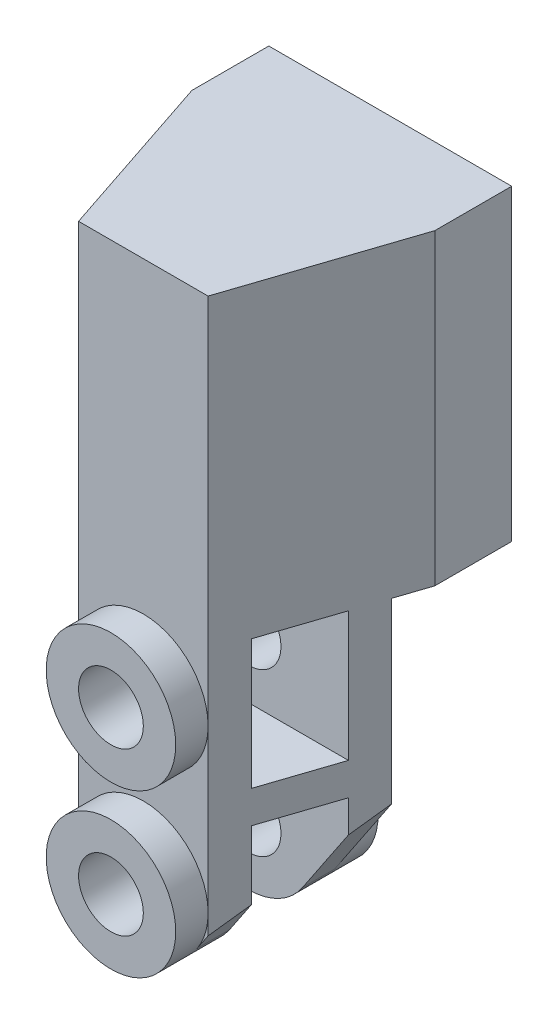
ISO-10303-21;
HEADER;
FILE_DESCRIPTION(('STEP AP214'),'2;1');
FILE_NAME('part.step','',(''),(''),'','','');
FILE_SCHEMA(('AUTOMOTIVE_DESIGN { 1 0 10303 214 1 1 1 1 }'));
ENDSEC;
DATA;
#1=APPLICATION_CONTEXT('core data for automotive mechanical design processes');
#2=APPLICATION_PROTOCOL_DEFINITION('international standard','automotive_design',2000,#1);
#3=PRODUCT_CONTEXT('',#1,'mechanical');
#4=PRODUCT('Part','Part','',(#3));
#5=PRODUCT_RELATED_PRODUCT_CATEGORY('part','',(#4));
#6=PRODUCT_DEFINITION_FORMATION('','',#4);
#7=PRODUCT_DEFINITION_CONTEXT('part definition',#1,'design');
#8=PRODUCT_DEFINITION('design','',#6,#7);
#9=PRODUCT_DEFINITION_SHAPE('','',#8);
#10=(LENGTH_UNIT() NAMED_UNIT(*) SI_UNIT(.MILLI.,.METRE.));
#11=(NAMED_UNIT(*) PLANE_ANGLE_UNIT() SI_UNIT($,.RADIAN.));
#12=(NAMED_UNIT(*) SI_UNIT($,.STERADIAN.) SOLID_ANGLE_UNIT());
#13=UNCERTAINTY_MEASURE_WITH_UNIT(LENGTH_MEASURE(1.E-05),#10,'distance_accuracy_value','');
#14=(GEOMETRIC_REPRESENTATION_CONTEXT(3) GLOBAL_UNCERTAINTY_ASSIGNED_CONTEXT((#13)) GLOBAL_UNIT_ASSIGNED_CONTEXT((#10,
#11,#12)) REPRESENTATION_CONTEXT('',''));
#15=CARTESIAN_POINT('',(0.,0.,0.));
#16=DIRECTION('',(0.,0.,1.));
#17=DIRECTION('',(1.,0.,0.));
#18=AXIS2_PLACEMENT_3D('',#15,#16,#17);
#19=CARTESIAN_POINT('',(-11.90625,-30.1625,10.715625));
#20=DIRECTION('',(0.,0.,1.));
#21=DIRECTION('',(1.,0.,0.));
#22=AXIS2_PLACEMENT_3D('',#19,#20,#21);
#23=PLANE('',#22);
#24=DIRECTION('',(0.,-1.,0.));
#25=VECTOR('',#24,1.);
#26=CARTESIAN_POINT('',(3.175,-30.1625,10.715625));
#27=LINE('',#26,#25);
#28=CARTESIAN_POINT('',(3.175,-30.1625,10.715625));
#29=VERTEX_POINT('',#28);
#30=CARTESIAN_POINT('',(3.175,-31.0132386859688,10.715625));
#31=VERTEX_POINT('',#30);
#32=EDGE_CURVE('E245',#29,#31,#27,.T.);
#33=ORIENTED_EDGE('',*,*,#32,.F.);
#34=DIRECTION('',(1.,0.,0.));
#35=VECTOR('',#34,1.);
#36=CARTESIAN_POINT('',(-11.90625,-30.1625,10.715625));
#37=LINE('',#36,#35);
#38=CARTESIAN_POINT('',(10.8479166666667,-30.1625,10.715625));
#39=VERTEX_POINT('',#38);
#40=EDGE_CURVE('E312',#29,#39,#37,.T.);
#41=ORIENTED_EDGE('',*,*,#40,.T.);
#42=DIRECTION('',(0.,1.,0.));
#43=VECTOR('',#42,1.);
#44=CARTESIAN_POINT('',(10.8479166666667,0.,10.715625));
#45=LINE('',#44,#43);
#46=CARTESIAN_POINT('',(10.8479166666667,-47.6151397515528,10.715625));
#47=VERTEX_POINT('',#46);
#48=EDGE_CURVE('E354',#47,#39,#45,.T.);
#49=ORIENTED_EDGE('',*,*,#48,.F.);
#50=DIRECTION('',(-0.557093425605536,-0.83044982698962,0.));
#51=VECTOR('',#50,1.);
#52=CARTESIAN_POINT('',(29.5098119035931,-19.796165485327,10.715625));
#53=LINE('',#52,#51);
#54=CARTESIAN_POINT('',(5.27335640138409,-55.9250432525952,10.715625));
#55=VERTEX_POINT('',#54);
#56=EDGE_CURVE('E351',#47,#55,#53,.T.);
#57=ORIENTED_EDGE('',*,*,#56,.T.);
#58=CARTESIAN_POINT('',(0.,-52.3875,10.715625));
#59=DIRECTION('',(0.,0.,1.));
#60=DIRECTION('',(1.,0.,0.));
#61=AXIS2_PLACEMENT_3D('',#58,#59,#60);
#62=CIRCLE('',#61,6.35);
#63=CARTESIAN_POINT('',(-5.27335640138409,-55.9250432525952,10.715625));
#64=VERTEX_POINT('',#63);
#65=EDGE_CURVE('E12',#64,#55,#62,.F.);
#66=ORIENTED_EDGE('',*,*,#65,.F.);
#67=DIRECTION('',(-0.557093425605536,0.83044982698962,0.));
#68=VECTOR('',#67,1.);
#69=CARTESIAN_POINT('',(-29.5098119035931,-19.796165485327,10.715625));
#70=LINE('',#69,#68);
#71=CARTESIAN_POINT('',(-10.8479166666667,-47.6151397515528,10.715625));
#72=VERTEX_POINT('',#71);
#73=EDGE_CURVE('E346',#64,#72,#70,.T.);
#74=ORIENTED_EDGE('',*,*,#73,.T.);
#75=DIRECTION('',(0.,-1.,0.));
#76=VECTOR('',#75,1.);
#77=CARTESIAN_POINT('',(-10.8479166666667,0.,10.715625));
#78=LINE('',#77,#76);
#79=CARTESIAN_POINT('',(-10.8479166666667,-30.1625,10.715625));
#80=VERTEX_POINT('',#79);
#81=EDGE_CURVE('E348',#80,#72,#78,.T.);
#82=ORIENTED_EDGE('',*,*,#81,.F.);
#83=CARTESIAN_POINT('',(-3.175,-30.1625,10.715625));
#84=VERTEX_POINT('',#83);
#85=EDGE_CURVE('E305',#80,#84,#37,.T.);
#86=ORIENTED_EDGE('',*,*,#85,.T.);
#87=DIRECTION('',(0.,1.,0.));
#88=VECTOR('',#87,1.);
#89=CARTESIAN_POINT('',(-3.175,-30.1625,10.715625));
#90=LINE('',#89,#88);
#91=CARTESIAN_POINT('',(-3.175,-31.0132386859688,10.715625));
#92=VERTEX_POINT('',#91);
#93=EDGE_CURVE('E78',#92,#84,#90,.T.);
#94=ORIENTED_EDGE('',*,*,#93,.F.);
#95=CARTESIAN_POINT('',(0.,-36.5125,10.715625));
#96=DIRECTION('',(0.,0.,-1.));
#97=DIRECTION('',(-1.,0.,0.));
#98=AXIS2_PLACEMENT_3D('',#95,#96,#97);
#99=CIRCLE('',#98,6.35);
#100=EDGE_CURVE('E73',#31,#92,#99,.T.);
#101=ORIENTED_EDGE('',*,*,#100,.F.);
#102=EDGE_LOOP('',(#33,#41,#49,#57,#66,#74,#82,#86,#94,#101));
#103=FACE_BOUND('',#102,.T.);
#104=ADVANCED_FACE('F58',(#103),#23,.F.);
#105=CARTESIAN_POINT('',(-11.90625,-30.1625,10.715625));
#106=DIRECTION('',(0.,1.,0.));
#107=DIRECTION('',(0.,0.,1.));
#108=AXIS2_PLACEMENT_3D('',#105,#106,#107);
#109=PLANE('',#108);
#110=DIRECTION('',(0.,0.,1.));
#111=VECTOR('',#110,1.);
#112=CARTESIAN_POINT('',(3.175,-30.1625,7.540625));
#113=LINE('',#112,#111);
#114=CARTESIAN_POINT('',(3.175,-30.1625,7.540625));
#115=VERTEX_POINT('',#114);
#116=EDGE_CURVE('E247',#115,#29,#113,.T.);
#117=ORIENTED_EDGE('',*,*,#116,.F.);
#118=DIRECTION('',(1.,0.,0.));
#119=VECTOR('',#118,1.);
#120=CARTESIAN_POINT('',(3.175,-30.1625,7.540625));
#121=LINE('',#120,#119);
#122=CARTESIAN_POINT('',(-3.175,-30.1625,7.540625));
#123=VERTEX_POINT('',#122);
#124=EDGE_CURVE('E238',#123,#115,#121,.T.);
#125=ORIENTED_EDGE('',*,*,#124,.F.);
#126=DIRECTION('',(0.,0.,1.));
#127=VECTOR('',#126,1.);
#128=CARTESIAN_POINT('',(-3.175,-30.1625,7.540625));
#129=LINE('',#128,#127);
#130=EDGE_CURVE('E255',#123,#84,#129,.T.);
#131=ORIENTED_EDGE('',*,*,#130,.T.);
#132=ORIENTED_EDGE('',*,*,#85,.F.);
#133=DIRECTION('',(0.316227766016838,0.,0.948683298050514));
#134=VECTOR('',#133,1.);
#135=CARTESIAN_POINT('',(-12.9778125,-30.1625,4.32593749999999));
#136=LINE('',#135,#134);
#137=CARTESIAN_POINT('',(-11.90625,-30.1625,7.54062499999998));
#138=VERTEX_POINT('',#137);
#139=EDGE_CURVE('E380',#138,#80,#136,.T.);
#140=ORIENTED_EDGE('',*,*,#139,.F.);
#141=DIRECTION('',(0.,0.,1.));
#142=VECTOR('',#141,1.);
#143=CARTESIAN_POINT('',(-11.90625,-30.1625,10.715625));
#144=LINE('',#143,#142);
#145=CARTESIAN_POINT('',(-11.90625,-30.1625,0.));
#146=VERTEX_POINT('',#145);
#147=EDGE_CURVE('E307',#146,#138,#144,.T.);
#148=ORIENTED_EDGE('',*,*,#147,.F.);
#149=DIRECTION('',(1.,0.,0.));
#150=VECTOR('',#149,1.);
#151=CARTESIAN_POINT('',(-11.90625,-30.1625,0.));
#152=LINE('',#151,#150);
#153=CARTESIAN_POINT('',(11.90625,-30.1625,0.));
#154=VERTEX_POINT('',#153);
#155=EDGE_CURVE('E310',#146,#154,#152,.T.);
#156=ORIENTED_EDGE('',*,*,#155,.T.);
#157=DIRECTION('',(0.,0.,1.));
#158=VECTOR('',#157,1.);
#159=CARTESIAN_POINT('',(11.90625,-30.1625,10.715625));
#160=LINE('',#159,#158);
#161=CARTESIAN_POINT('',(11.90625,-30.1625,7.54062499999997));
#162=VERTEX_POINT('',#161);
#163=EDGE_CURVE('E290',#154,#162,#160,.T.);
#164=ORIENTED_EDGE('',*,*,#163,.T.);
#165=DIRECTION('',(0.316227766016838,0.,-0.948683298050514));
#166=VECTOR('',#165,1.);
#167=CARTESIAN_POINT('',(12.9778125,-30.1625,4.32593749999999));
#168=LINE('',#167,#166);
#169=EDGE_CURVE('E457',#39,#162,#168,.T.);
#170=ORIENTED_EDGE('',*,*,#169,.F.);
#171=ORIENTED_EDGE('',*,*,#40,.F.);
#172=EDGE_LOOP('',(#117,#125,#131,#132,#140,#148,#156,#164,#170,#171));
#173=FACE_BOUND('',#172,.T.);
#174=ADVANCED_FACE('F488',(#173),#109,.F.);
#175=CARTESIAN_POINT('',(0.,0.,24.209375));
#176=DIRECTION('',(0.,0.,-1.));
#177=DIRECTION('',(-1.,0.,0.));
#178=AXIS2_PLACEMENT_3D('',#175,#176,#177);
#179=PLANE('',#178);
#180=CARTESIAN_POINT('',(0.,-52.3875,24.209375));
#181=DIRECTION('',(0.,0.,1.));
#182=DIRECTION('',(1.,0.,0.));
#183=AXIS2_PLACEMENT_3D('',#180,#181,#182);
#184=CIRCLE('',#183,6.35);
#185=CARTESIAN_POINT('',(-6.35,-52.3875,24.209375));
#186=VERTEX_POINT('',#185);
#187=CARTESIAN_POINT('',(-5.27335640138409,-55.9250432525952,24.209375));
#188=VERTEX_POINT('',#187);
#189=EDGE_CURVE('E283',#186,#188,#184,.T.);
#190=ORIENTED_EDGE('',*,*,#189,.F.);
#191=DIRECTION('',(0.,-1.,0.));
#192=VECTOR('',#191,1.);
#193=CARTESIAN_POINT('',(-6.35,0.,24.209375));
#194=LINE('',#193,#192);
#195=CARTESIAN_POINT('',(-6.35,-54.3201086956522,24.209375));
#196=VERTEX_POINT('',#195);
#197=EDGE_CURVE('E406',#186,#196,#194,.T.);
#198=ORIENTED_EDGE('',*,*,#197,.T.);
#199=DIRECTION('',(0.557093425605536,-0.83044982698962,0.));
#200=VECTOR('',#199,1.);
#201=CARTESIAN_POINT('',(-29.5098119035931,-19.796165485327,24.209375));
#202=LINE('',#201,#200);
#203=EDGE_CURVE('E383',#196,#188,#202,.T.);
#204=ORIENTED_EDGE('',*,*,#203,.T.);
#205=EDGE_LOOP('',(#190,#198,#204));
#206=FACE_BOUND('',#205,.T.);
#207=ADVANCED_FACE('F533',(#206),#179,.F.);
#208=CARTESIAN_POINT('',(5.27335640138408,-55.9250432525952,24.209375));
#209=VERTEX_POINT('',#208);
#210=CARTESIAN_POINT('',(6.35,-52.3875,24.209375));
#211=VERTEX_POINT('',#210);
#212=EDGE_CURVE('E275',#209,#211,#184,.T.);
#213=ORIENTED_EDGE('',*,*,#212,.F.);
#214=DIRECTION('',(0.557093425605536,0.83044982698962,0.));
#215=VECTOR('',#214,1.);
#216=CARTESIAN_POINT('',(29.5098119035931,-19.796165485327,24.209375));
#217=LINE('',#216,#215);
#218=CARTESIAN_POINT('',(6.35,-54.3201086956522,24.209375));
#219=VERTEX_POINT('',#218);
#220=EDGE_CURVE('E389',#209,#219,#217,.T.);
#221=ORIENTED_EDGE('',*,*,#220,.T.);
#222=DIRECTION('',(0.,-1.,0.));
#223=VECTOR('',#222,1.);
#224=CARTESIAN_POINT('',(6.35,0.,24.209375));
#225=LINE('',#224,#223);
#226=EDGE_CURVE('E412',#211,#219,#225,.T.);
#227=ORIENTED_EDGE('',*,*,#226,.F.);
#228=EDGE_LOOP('',(#213,#221,#227));
#229=FACE_BOUND('',#228,.T.);
#230=ADVANCED_FACE('F579',(#229),#179,.F.);
#231=EDGE_CURVE('E280',#211,#186,#184,.T.);
#232=ORIENTED_EDGE('',*,*,#231,.F.);
#233=CARTESIAN_POINT('',(6.35,-36.5125,24.209375));
#234=VERTEX_POINT('',#233);
#235=EDGE_CURVE('E417',#234,#211,#225,.T.);
#236=ORIENTED_EDGE('',*,*,#235,.F.);
#237=CARTESIAN_POINT('',(0.,-36.5125,24.209375));
#238=DIRECTION('',(0.,0.,1.));
#239=DIRECTION('',(1.,0.,0.));
#240=AXIS2_PLACEMENT_3D('',#237,#238,#239);
#241=CIRCLE('',#240,6.35);
#242=CARTESIAN_POINT('',(-6.35,-36.5125,24.209375));
#243=VERTEX_POINT('',#242);
#244=EDGE_CURVE('E66',#243,#234,#241,.T.);
#245=ORIENTED_EDGE('',*,*,#244,.F.);
#246=EDGE_CURVE('E405',#243,#186,#194,.T.);
#247=ORIENTED_EDGE('',*,*,#246,.T.);
#248=EDGE_LOOP('',(#232,#236,#245,#247));
#249=FACE_BOUND('',#248,.T.);
#250=ADVANCED_FACE('F469',(#249),#179,.F.);
#251=EDGE_CURVE('E286',#234,#243,#241,.T.);
#252=ORIENTED_EDGE('',*,*,#251,.F.);
#253=CARTESIAN_POINT('',(6.35,0.,24.209375));
#254=VERTEX_POINT('',#253);
#255=EDGE_CURVE('E415',#254,#234,#225,.T.);
#256=ORIENTED_EDGE('',*,*,#255,.F.);
#257=DIRECTION('',(-1.,0.,0.));
#258=VECTOR('',#257,1.);
#259=CARTESIAN_POINT('',(-11.90625,0.,24.209375));
#260=LINE('',#259,#258);
#261=CARTESIAN_POINT('',(-6.35,0.,24.209375));
#262=VERTEX_POINT('',#261);
#263=EDGE_CURVE('E418',#254,#262,#260,.T.);
#264=ORIENTED_EDGE('',*,*,#263,.T.);
#265=EDGE_CURVE('E401',#262,#243,#194,.T.);
#266=ORIENTED_EDGE('',*,*,#265,.T.);
#267=EDGE_LOOP('',(#252,#256,#264,#266));
#268=FACE_BOUND('',#267,.T.);
#269=ADVANCED_FACE('F476',(#268),#179,.F.);
#270=CARTESIAN_POINT('',(29.5098119035931,-19.796165485327,0.));
#271=DIRECTION('',(0.83044982698962,-0.557093425605536,0.));
#272=DIRECTION('',(0.557093425605536,0.83044982698962,0.));
#273=AXIS2_PLACEMENT_3D('',#270,#271,#272);
#274=PLANE('',#273);
#275=ORIENTED_EDGE('',*,*,#56,.F.);
#276=DIRECTION('',(-0.286039779962673,-0.426394703049948,0.85811933988802));
#277=VECTOR('',#276,1.);
#278=CARTESIAN_POINT('',(18.39799178727,-36.3603693854361,-11.9346003618099));
#279=LINE('',#278,#277);
#280=CARTESIAN_POINT('',(9.78958333333332,-49.1927795031056,13.890625));
#281=VERTEX_POINT('',#280);
#282=EDGE_CURVE('E436',#47,#281,#279,.T.);
#283=ORIENTED_EDGE('',*,*,#282,.T.);
#284=DIRECTION('',(0.557093425605536,0.83044982698962,0.));
#285=VECTOR('',#284,1.);
#286=CARTESIAN_POINT('',(29.5098119035931,-19.796165485327,13.890625));
#287=LINE('',#286,#285);
#288=CARTESIAN_POINT('',(5.27335640138408,-55.9250432525952,13.890625));
#289=VERTEX_POINT('',#288);
#290=EDGE_CURVE('E339',#289,#281,#287,.T.);
#291=ORIENTED_EDGE('',*,*,#290,.F.);
#292=DIRECTION('',(0.,0.,1.));
#293=VECTOR('',#292,1.);
#294=CARTESIAN_POINT('',(5.27335640138409,-55.9250432525952,0.));
#295=LINE('',#294,#293);
#296=EDGE_CURVE('E395',#55,#289,#295,.T.);
#297=ORIENTED_EDGE('',*,*,#296,.F.);
#298=EDGE_LOOP('',(#275,#283,#291,#297));
#299=FACE_BOUND('',#298,.T.);
#300=ADVANCED_FACE('F503',(#299),#274,.T.);
#301=CARTESIAN_POINT('',(0.,-52.3875,0.));
#302=DIRECTION('',(0.,0.,1.));
#303=DIRECTION('',(1.,0.,0.));
#304=AXIS2_PLACEMENT_3D('',#301,#302,#303);
#305=CYLINDRICAL_SURFACE('',#304,6.35);
#306=DIRECTION('',(0.,0.,1.));
#307=VECTOR('',#306,1.);
#308=CARTESIAN_POINT('',(-5.27335640138409,-55.9250432525952,0.));
#309=LINE('',#308,#307);
#310=CARTESIAN_POINT('',(-5.27335640138409,-55.9250432525952,13.890625));
#311=VERTEX_POINT('',#310);
#312=EDGE_CURVE('E388',#64,#311,#309,.T.);
#313=ORIENTED_EDGE('',*,*,#312,.F.);
#314=ORIENTED_EDGE('',*,*,#65,.T.);
#315=ORIENTED_EDGE('',*,*,#296,.T.);
#316=CARTESIAN_POINT('',(0.,-52.3875,13.890625));
#317=DIRECTION('',(0.,0.,-1.));
#318=DIRECTION('',(0.,1.,0.));
#319=AXIS2_PLACEMENT_3D('',#316,#317,#318);
#320=CIRCLE('',#319,6.35);
#321=EDGE_CURVE('E337',#311,#289,#320,.F.);
#322=ORIENTED_EDGE('',*,*,#321,.F.);
#323=EDGE_LOOP('',(#313,#314,#315,#322));
#324=FACE_BOUND('',#323,.T.);
#325=CARTESIAN_POINT('',(0.,-52.3875,7.540625));
#326=DIRECTION('',(0.,0.,-1.));
#327=DIRECTION('',(-1.,0.,0.));
#328=AXIS2_PLACEMENT_3D('',#325,#326,#327);
#329=CIRCLE('',#328,6.35);
#330=CARTESIAN_POINT('',(-6.35,-52.3875,7.540625));
#331=VERTEX_POINT('',#330);
#332=EDGE_CURVE('E269',#331,#331,#329,.T.);
#333=ORIENTED_EDGE('',*,*,#332,.F.);
#334=EDGE_LOOP('',(#333));
#335=FACE_BOUND('',#334,.T.);
#336=ADVANCED_FACE('F508',(#324,#335),#305,.T.);
#337=CARTESIAN_POINT('',(-29.5098119035931,-19.796165485327,0.));
#338=DIRECTION('',(-0.83044982698962,-0.557093425605536,0.));
#339=DIRECTION('',(0.557093425605536,-0.83044982698962,0.));
#340=AXIS2_PLACEMENT_3D('',#337,#338,#339);
#341=PLANE('',#340);
#342=ORIENTED_EDGE('',*,*,#73,.F.);
#343=ORIENTED_EDGE('',*,*,#312,.T.);
#344=DIRECTION('',(0.557093425605536,-0.83044982698962,0.));
#345=VECTOR('',#344,1.);
#346=CARTESIAN_POINT('',(-29.5098119035931,-19.796165485327,13.890625));
#347=LINE('',#346,#345);
#348=CARTESIAN_POINT('',(-9.78958333333332,-49.1927795031056,13.890625));
#349=VERTEX_POINT('',#348);
#350=EDGE_CURVE('E333',#349,#311,#347,.T.);
#351=ORIENTED_EDGE('',*,*,#350,.F.);
#352=DIRECTION('',(-0.286039779962673,0.426394703049948,-0.858119339888021));
#353=VECTOR('',#352,1.);
#354=CARTESIAN_POINT('',(-18.39799178727,-36.3603693854361,-11.9346003618099));
#355=LINE('',#354,#353);
#356=EDGE_CURVE('E441',#349,#72,#355,.T.);
#357=ORIENTED_EDGE('',*,*,#356,.T.);
#358=EDGE_LOOP('',(#342,#343,#351,#357));
#359=FACE_BOUND('',#358,.T.);
#360=ADVANCED_FACE('F514',(#359),#341,.T.);
#361=CARTESIAN_POINT('',(0.,0.,0.));
#362=DIRECTION('',(0.,0.,-1.));
#363=DIRECTION('',(-1.,0.,0.));
#364=AXIS2_PLACEMENT_3D('',#361,#362,#363);
#365=PLANE('',#364);
#366=ORIENTED_EDGE('',*,*,#155,.F.);
#367=DIRECTION('',(0.,-1.,0.));
#368=VECTOR('',#367,1.);
#369=CARTESIAN_POINT('',(-11.90625,-58.7375,0.));
#370=LINE('',#369,#368);
#371=CARTESIAN_POINT('',(-11.90625,0.,0.));
#372=VERTEX_POINT('',#371);
#373=EDGE_CURVE('E404',#372,#146,#370,.T.);
#374=ORIENTED_EDGE('',*,*,#373,.F.);
#375=DIRECTION('',(-1.,0.,0.));
#376=VECTOR('',#375,1.);
#377=CARTESIAN_POINT('',(-11.90625,0.,0.));
#378=LINE('',#377,#376);
#379=CARTESIAN_POINT('',(11.90625,0.,0.));
#380=VERTEX_POINT('',#379);
#381=EDGE_CURVE('E422',#380,#372,#378,.T.);
#382=ORIENTED_EDGE('',*,*,#381,.F.);
#383=DIRECTION('',(0.,1.,0.));
#384=VECTOR('',#383,1.);
#385=CARTESIAN_POINT('',(11.90625,-25.4,0.));
#386=LINE('',#385,#384);
#387=EDGE_CURVE('E425',#154,#380,#386,.T.);
#388=ORIENTED_EDGE('',*,*,#387,.F.);
#389=EDGE_LOOP('',(#366,#374,#382,#388));
#390=FACE_BOUND('',#389,.T.);
#391=ADVANCED_FACE('F493',(#390),#365,.T.);
#392=CARTESIAN_POINT('',(-11.90625,-58.7375,24.209375));
#393=DIRECTION('',(1.,0.,0.));
#394=DIRECTION('',(0.,1.,0.));
#395=AXIS2_PLACEMENT_3D('',#392,#393,#394);
#396=PLANE('',#395);
#397=ORIENTED_EDGE('',*,*,#373,.T.);
#398=ORIENTED_EDGE('',*,*,#147,.T.);
#399=DIRECTION('',(0.,-1.,0.));
#400=VECTOR('',#399,1.);
#401=CARTESIAN_POINT('',(-11.90625,0.,7.540625));
#402=LINE('',#401,#400);
#403=CARTESIAN_POINT('',(-11.90625,0.,7.540625));
#404=VERTEX_POINT('',#403);
#405=EDGE_CURVE('E399',#404,#138,#402,.T.);
#406=ORIENTED_EDGE('',*,*,#405,.F.);
#407=DIRECTION('',(0.,0.,-1.));
#408=VECTOR('',#407,1.);
#409=CARTESIAN_POINT('',(-11.90625,0.,24.209375));
#410=LINE('',#409,#408);
#411=EDGE_CURVE('E421',#404,#372,#410,.T.);
#412=ORIENTED_EDGE('',*,*,#411,.T.);
#413=EDGE_LOOP('',(#397,#398,#406,#412));
#414=FACE_BOUND('',#413,.T.);
#415=ADVANCED_FACE('F60',(#414),#396,.F.);
#416=CARTESIAN_POINT('',(-12.9778125,0.,4.32593749999999));
#417=DIRECTION('',(0.948683298050514,0.,-0.316227766016838));
#418=DIRECTION('',(-0.316227766016838,0.,-0.948683298050514));
#419=AXIS2_PLACEMENT_3D('',#416,#417,#418);
#420=PLANE('',#419);
#421=DIRECTION('',(-0.316227766016838,0.,-0.948683298050514));
#422=VECTOR('',#421,1.);
#423=CARTESIAN_POINT('',(-12.9778125,-42.8625,4.32593749999999));
#424=LINE('',#423,#422);
#425=CARTESIAN_POINT('',(-7.40833333333333,-42.8625,21.034375));
#426=VERTEX_POINT('',#425);
#427=CARTESIAN_POINT('',(-9.78958333333333,-42.8625,13.890625));
#428=VERTEX_POINT('',#427);
#429=EDGE_CURVE('E377',#426,#428,#424,.T.);
#430=ORIENTED_EDGE('',*,*,#429,.T.);
#431=DIRECTION('',(0.,1.,0.));
#432=VECTOR('',#431,1.);
#433=CARTESIAN_POINT('',(-9.78958333333333,0.,13.890625));
#434=LINE('',#433,#432);
#435=CARTESIAN_POINT('',(-9.78958333333333,-30.1625,13.890625));
#436=VERTEX_POINT('',#435);
#437=EDGE_CURVE('E368',#428,#436,#434,.T.);
#438=ORIENTED_EDGE('',*,*,#437,.T.);
#439=DIRECTION('',(0.316227766016838,0.,0.948683298050514));
#440=VECTOR('',#439,1.);
#441=CARTESIAN_POINT('',(-12.9778125,-30.1625,4.32593749999999));
#442=LINE('',#441,#440);
#443=CARTESIAN_POINT('',(-7.40833333333333,-30.1625,21.034375));
#444=VERTEX_POINT('',#443);
#445=EDGE_CURVE('E374',#436,#444,#442,.T.);
#446=ORIENTED_EDGE('',*,*,#445,.T.);
#447=DIRECTION('',(0.,-1.,0.));
#448=VECTOR('',#447,1.);
#449=CARTESIAN_POINT('',(-7.40833333333333,0.,21.034375));
#450=LINE('',#449,#448);
#451=EDGE_CURVE('E361',#444,#426,#450,.T.);
#452=ORIENTED_EDGE('',*,*,#451,.T.);
#453=EDGE_LOOP('',(#430,#438,#446,#452));
#454=FACE_BOUND('',#453,.T.);
#455=ORIENTED_EDGE('',*,*,#139,.T.);
#456=ORIENTED_EDGE('',*,*,#81,.T.);
#457=ORIENTED_EDGE('',*,*,#356,.F.);
#458=DIRECTION('',(0.,1.,0.));
#459=VECTOR('',#458,1.);
#460=CARTESIAN_POINT('',(-9.78958333333333,0.,13.890625));
#461=LINE('',#460,#459);
#462=CARTESIAN_POINT('',(-9.78958333333333,-46.0375,13.890625));
#463=VERTEX_POINT('',#462);
#464=EDGE_CURVE('E336',#349,#463,#461,.T.);
#465=ORIENTED_EDGE('',*,*,#464,.T.);
#466=DIRECTION('',(0.316227766016838,0.,0.948683298050514));
#467=VECTOR('',#466,1.);
#468=CARTESIAN_POINT('',(-12.9778125,-46.0375,4.32593749999995));
#469=LINE('',#468,#467);
#470=CARTESIAN_POINT('',(-7.40833333333333,-46.0375,21.034375));
#471=VERTEX_POINT('',#470);
#472=EDGE_CURVE('E371',#463,#471,#469,.T.);
#473=ORIENTED_EDGE('',*,*,#472,.T.);
#474=DIRECTION('',(0.,-1.,0.));
#475=VECTOR('',#474,1.);
#476=CARTESIAN_POINT('',(-7.40833333333333,0.,21.034375));
#477=LINE('',#476,#475);
#478=CARTESIAN_POINT('',(-7.40833333333332,-52.7424689440994,21.034375));
#479=VERTEX_POINT('',#478);
#480=EDGE_CURVE('E322',#471,#479,#477,.T.);
#481=ORIENTED_EDGE('',*,*,#480,.T.);
#482=EDGE_CURVE('E437',#196,#479,#355,.T.);
#483=ORIENTED_EDGE('',*,*,#482,.F.);
#484=ORIENTED_EDGE('',*,*,#197,.F.);
#485=ORIENTED_EDGE('',*,*,#246,.F.);
#486=ORIENTED_EDGE('',*,*,#265,.F.);
#487=DIRECTION('',(0.316227766016838,0.,0.948683298050514));
#488=VECTOR('',#487,1.);
#489=CARTESIAN_POINT('',(-12.9778125,0.,4.32593749999999));
#490=LINE('',#489,#488);
#491=EDGE_CURVE('E396',#404,#262,#490,.T.);
#492=ORIENTED_EDGE('',*,*,#491,.F.);
#493=ORIENTED_EDGE('',*,*,#405,.T.);
#494=EDGE_LOOP('',(#455,#456,#457,#465,#473,#481,#483,#484,#485,#486,#492,#493));
#495=FACE_BOUND('',#494,.T.);
#496=ADVANCED_FACE('F473',(#454,#495),#420,.F.);
#497=CARTESIAN_POINT('',(11.90625,-25.4,24.209375));
#498=DIRECTION('',(-1.,0.,0.));
#499=DIRECTION('',(0.,0.,1.));
#500=AXIS2_PLACEMENT_3D('',#497,#498,#499);
#501=PLANE('',#500);
#502=DIRECTION('',(0.,-1.,0.));
#503=VECTOR('',#502,1.);
#504=CARTESIAN_POINT('',(11.90625,0.,7.54062499999998));
#505=LINE('',#504,#503);
#506=CARTESIAN_POINT('',(11.90625,0.,7.54062499999998));
#507=VERTEX_POINT('',#506);
#508=EDGE_CURVE('E400',#507,#162,#505,.T.);
#509=ORIENTED_EDGE('',*,*,#508,.T.);
#510=ORIENTED_EDGE('',*,*,#163,.F.);
#511=ORIENTED_EDGE('',*,*,#387,.T.);
#512=DIRECTION('',(0.,0.,-1.));
#513=VECTOR('',#512,1.);
#514=CARTESIAN_POINT('',(11.90625,0.,24.209375));
#515=LINE('',#514,#513);
#516=EDGE_CURVE('E430',#507,#380,#515,.T.);
#517=ORIENTED_EDGE('',*,*,#516,.F.);
#518=EDGE_LOOP('',(#509,#510,#511,#517));
#519=FACE_BOUND('',#518,.T.);
#520=ADVANCED_FACE('F496',(#519),#501,.F.);
#521=CARTESIAN_POINT('',(12.9778125,0.,4.32593749999999));
#522=DIRECTION('',(-0.948683298050514,0.,-0.316227766016838));
#523=DIRECTION('',(-0.316227766016838,0.,0.948683298050514));
#524=AXIS2_PLACEMENT_3D('',#521,#522,#523);
#525=PLANE('',#524);
#526=DIRECTION('',(0.316227766016838,0.,-0.948683298050514));
#527=VECTOR('',#526,1.);
#528=CARTESIAN_POINT('',(12.9778125,-30.1625,4.32593749999999));
#529=LINE('',#528,#527);
#530=CARTESIAN_POINT('',(7.40833333333332,-30.1625,21.034375));
#531=VERTEX_POINT('',#530);
#532=CARTESIAN_POINT('',(9.78958333333333,-30.1625,13.890625));
#533=VERTEX_POINT('',#532);
#534=EDGE_CURVE('E452',#531,#533,#529,.T.);
#535=ORIENTED_EDGE('',*,*,#534,.T.);
#536=DIRECTION('',(0.,-1.,0.));
#537=VECTOR('',#536,1.);
#538=CARTESIAN_POINT('',(9.78958333333333,0.,13.890625));
#539=LINE('',#538,#537);
#540=CARTESIAN_POINT('',(9.78958333333332,-42.8625,13.890625));
#541=VERTEX_POINT('',#540);
#542=EDGE_CURVE('E365',#533,#541,#539,.T.);
#543=ORIENTED_EDGE('',*,*,#542,.T.);
#544=DIRECTION('',(-0.316227766016838,0.,0.948683298050514));
#545=VECTOR('',#544,1.);
#546=CARTESIAN_POINT('',(12.9778125,-42.8625,4.32593749999999));
#547=LINE('',#546,#545);
#548=CARTESIAN_POINT('',(7.40833333333333,-42.8625,21.034375));
#549=VERTEX_POINT('',#548);
#550=EDGE_CURVE('E455',#541,#549,#547,.T.);
#551=ORIENTED_EDGE('',*,*,#550,.T.);
#552=DIRECTION('',(0.,1.,0.));
#553=VECTOR('',#552,1.);
#554=CARTESIAN_POINT('',(7.40833333333333,0.,21.034375));
#555=LINE('',#554,#553);
#556=EDGE_CURVE('E358',#549,#531,#555,.T.);
#557=ORIENTED_EDGE('',*,*,#556,.T.);
#558=EDGE_LOOP('',(#535,#543,#551,#557));
#559=FACE_BOUND('',#558,.T.);
#560=ORIENTED_EDGE('',*,*,#282,.F.);
#561=ORIENTED_EDGE('',*,*,#48,.T.);
#562=ORIENTED_EDGE('',*,*,#169,.T.);
#563=ORIENTED_EDGE('',*,*,#508,.F.);
#564=DIRECTION('',(0.316227766016838,0.,-0.948683298050514));
#565=VECTOR('',#564,1.);
#566=CARTESIAN_POINT('',(12.9778125,0.,4.32593749999999));
#567=LINE('',#566,#565);
#568=EDGE_CURVE('E409',#254,#507,#567,.T.);
#569=ORIENTED_EDGE('',*,*,#568,.F.);
#570=ORIENTED_EDGE('',*,*,#255,.T.);
#571=ORIENTED_EDGE('',*,*,#235,.T.);
#572=ORIENTED_EDGE('',*,*,#226,.T.);
#573=CARTESIAN_POINT('',(7.40833333333333,-52.7424689440994,21.034375));
#574=VERTEX_POINT('',#573);
#575=EDGE_CURVE('E433',#574,#219,#279,.T.);
#576=ORIENTED_EDGE('',*,*,#575,.F.);
#577=DIRECTION('',(0.,1.,0.));
#578=VECTOR('',#577,1.);
#579=CARTESIAN_POINT('',(7.40833333333333,0.,21.034375));
#580=LINE('',#579,#578);
#581=CARTESIAN_POINT('',(7.40833333333332,-46.0375,21.034375));
#582=VERTEX_POINT('',#581);
#583=EDGE_CURVE('E329',#574,#582,#580,.T.);
#584=ORIENTED_EDGE('',*,*,#583,.T.);
#585=DIRECTION('',(0.316227766016838,0.,-0.948683298050514));
#586=VECTOR('',#585,1.);
#587=CARTESIAN_POINT('',(12.9778125,-46.0375,4.32593749999995));
#588=LINE('',#587,#586);
#589=CARTESIAN_POINT('',(9.78958333333332,-46.0375,13.890625));
#590=VERTEX_POINT('',#589);
#591=EDGE_CURVE('E440',#582,#590,#588,.T.);
#592=ORIENTED_EDGE('',*,*,#591,.T.);
#593=DIRECTION('',(0.,-1.,0.));
#594=VECTOR('',#593,1.);
#595=CARTESIAN_POINT('',(9.78958333333333,0.,13.890625));
#596=LINE('',#595,#594);
#597=EDGE_CURVE('E343',#590,#281,#596,.T.);
#598=ORIENTED_EDGE('',*,*,#597,.T.);
#599=EDGE_LOOP('',(#560,#561,#562,#563,#569,#570,#571,#572,#576,#584,#592,#598));
#600=FACE_BOUND('',#599,.T.);
#601=ADVANCED_FACE('F499',(#559,#600),#525,.F.);
#602=CARTESIAN_POINT('',(-11.90625,0.,24.209375));
#603=DIRECTION('',(0.,-1.,0.));
#604=DIRECTION('',(0.,0.,-1.));
#605=AXIS2_PLACEMENT_3D('',#602,#603,#604);
#606=PLANE('',#605);
#607=ORIENTED_EDGE('',*,*,#411,.F.);
#608=ORIENTED_EDGE('',*,*,#491,.T.);
#609=ORIENTED_EDGE('',*,*,#263,.F.);
#610=ORIENTED_EDGE('',*,*,#568,.T.);
#611=ORIENTED_EDGE('',*,*,#516,.T.);
#612=ORIENTED_EDGE('',*,*,#381,.T.);
#613=EDGE_LOOP('',(#607,#608,#609,#610,#611,#612));
#614=FACE_BOUND('',#613,.T.);
#615=ADVANCED_FACE('F481',(#614),#606,.F.);
#616=DIRECTION('',(-0.557093425605536,-0.83044982698962,0.));
#617=VECTOR('',#616,1.);
#618=CARTESIAN_POINT('',(29.5098119035931,-19.796165485327,21.034375));
#619=LINE('',#618,#617);
#620=CARTESIAN_POINT('',(5.27335640138408,-55.9250432525952,21.034375));
#621=VERTEX_POINT('',#620);
#622=EDGE_CURVE('E325',#574,#621,#619,.T.);
#623=ORIENTED_EDGE('',*,*,#622,.F.);
#624=ORIENTED_EDGE('',*,*,#575,.T.);
#625=ORIENTED_EDGE('',*,*,#220,.F.);
#626=EDGE_CURVE('E392',#621,#209,#295,.T.);
#627=ORIENTED_EDGE('',*,*,#626,.F.);
#628=EDGE_LOOP('',(#623,#624,#625,#627));
#629=FACE_BOUND('',#628,.T.);
#630=ADVANCED_FACE('F566',(#629),#274,.T.);
#631=CARTESIAN_POINT('',(-5.27335640138409,-55.9250432525952,21.034375));
#632=VERTEX_POINT('',#631);
#633=EDGE_CURVE('E386',#632,#188,#309,.T.);
#634=ORIENTED_EDGE('',*,*,#633,.F.);
#635=CARTESIAN_POINT('',(0.,-52.3875,21.034375));
#636=DIRECTION('',(0.,0.,1.));
#637=DIRECTION('',(1.,0.,0.));
#638=AXIS2_PLACEMENT_3D('',#635,#636,#637);
#639=CIRCLE('',#638,6.35);
#640=EDGE_CURVE('E323',#621,#632,#639,.F.);
#641=ORIENTED_EDGE('',*,*,#640,.F.);
#642=ORIENTED_EDGE('',*,*,#626,.T.);
#643=ORIENTED_EDGE('',*,*,#212,.T.);
#644=ORIENTED_EDGE('',*,*,#231,.T.);
#645=ORIENTED_EDGE('',*,*,#189,.T.);
#646=EDGE_LOOP('',(#634,#641,#642,#643,#644,#645));
#647=FACE_BOUND('',#646,.T.);
#648=CARTESIAN_POINT('',(0.,-52.3875,27.384375));
#649=DIRECTION('',(0.,0.,1.));
#650=DIRECTION('',(1.,0.,0.));
#651=AXIS2_PLACEMENT_3D('',#648,#649,#650);
#652=CIRCLE('',#651,6.35);
#653=CARTESIAN_POINT('',(6.35,-52.3875,27.384375));
#654=VERTEX_POINT('',#653);
#655=EDGE_CURVE('E276',#654,#654,#652,.T.);
#656=ORIENTED_EDGE('',*,*,#655,.F.);
#657=EDGE_LOOP('',(#656));
#658=FACE_BOUND('',#657,.T.);
#659=ADVANCED_FACE('F562',(#647,#658),#305,.T.);
#660=DIRECTION('',(-0.557093425605536,0.83044982698962,0.));
#661=VECTOR('',#660,1.);
#662=CARTESIAN_POINT('',(-29.5098119035931,-19.796165485327,21.034375));
#663=LINE('',#662,#661);
#664=EDGE_CURVE('E320',#632,#479,#663,.T.);
#665=ORIENTED_EDGE('',*,*,#664,.F.);
#666=ORIENTED_EDGE('',*,*,#633,.T.);
#667=ORIENTED_EDGE('',*,*,#203,.F.);
#668=ORIENTED_EDGE('',*,*,#482,.T.);
#669=EDGE_LOOP('',(#665,#666,#667,#668));
#670=FACE_BOUND('',#669,.T.);
#671=ADVANCED_FACE('F557',(#670),#341,.T.);
#672=CARTESIAN_POINT('',(0.,-36.5125,0.));
#673=DIRECTION('',(0.,0.,1.));
#674=DIRECTION('',(1.,0.,0.));
#675=AXIS2_PLACEMENT_3D('',#672,#673,#674);
#676=CYLINDRICAL_SURFACE('',#675,3.175);
#677=CARTESIAN_POINT('',(0.,-36.5125,21.034375));
#678=DIRECTION('',(0.,0.,1.));
#679=DIRECTION('',(1.,0.,0.));
#680=AXIS2_PLACEMENT_3D('',#677,#678,#679);
#681=CIRCLE('',#680,3.175);
#682=CARTESIAN_POINT('',(3.175,-36.5125,21.034375));
#683=VERTEX_POINT('',#682);
#684=EDGE_CURVE('E357',#683,#683,#681,.F.);
#685=ORIENTED_EDGE('',*,*,#684,.T.);
#686=EDGE_LOOP('',(#685));
#687=FACE_BOUND('',#686,.T.);
#688=CARTESIAN_POINT('',(0.,-36.5125,27.384375));
#689=DIRECTION('',(0.,0.,1.));
#690=DIRECTION('',(1.,0.,0.));
#691=AXIS2_PLACEMENT_3D('',#688,#689,#690);
#692=CIRCLE('',#691,3.175);
#693=CARTESIAN_POINT('',(3.175,-36.5125,27.384375));
#694=VERTEX_POINT('',#693);
#695=EDGE_CURVE('E279',#694,#694,#692,.T.);
#696=ORIENTED_EDGE('',*,*,#695,.T.);
#697=EDGE_LOOP('',(#696));
#698=FACE_BOUND('',#697,.T.);
#699=ADVANCED_FACE('F553',(#687,#698),#676,.F.);
#700=CARTESIAN_POINT('',(0.,-52.3875,0.));
#701=DIRECTION('',(0.,0.,1.));
#702=DIRECTION('',(1.,0.,0.));
#703=AXIS2_PLACEMENT_3D('',#700,#701,#702);
#704=CYLINDRICAL_SURFACE('',#703,3.175);
#705=CARTESIAN_POINT('',(0.,-52.3875,21.034375));
#706=DIRECTION('',(0.,0.,1.));
#707=DIRECTION('',(1.,0.,0.));
#708=AXIS2_PLACEMENT_3D('',#705,#706,#707);
#709=CIRCLE('',#708,3.175);
#710=CARTESIAN_POINT('',(3.175,-52.3875,21.034375));
#711=VERTEX_POINT('',#710);
#712=EDGE_CURVE('E317',#711,#711,#709,.F.);
#713=ORIENTED_EDGE('',*,*,#712,.T.);
#714=EDGE_LOOP('',(#713));
#715=FACE_BOUND('',#714,.T.);
#716=CARTESIAN_POINT('',(0.,-52.3875,27.384375));
#717=DIRECTION('',(0.,0.,1.));
#718=DIRECTION('',(1.,0.,0.));
#719=AXIS2_PLACEMENT_3D('',#716,#717,#718);
#720=CIRCLE('',#719,3.175);
#721=CARTESIAN_POINT('',(3.175,-52.3875,27.384375));
#722=VERTEX_POINT('',#721);
#723=EDGE_CURVE('E272',#722,#722,#720,.T.);
#724=ORIENTED_EDGE('',*,*,#723,.T.);
#725=EDGE_LOOP('',(#724));
#726=FACE_BOUND('',#725,.T.);
#727=ADVANCED_FACE('F546',(#715,#726),#704,.F.);
#728=CARTESIAN_POINT('',(-11.90625,-46.0375,13.890625));
#729=DIRECTION('',(0.,1.,0.));
#730=DIRECTION('',(0.,0.,1.));
#731=AXIS2_PLACEMENT_3D('',#728,#729,#730);
#732=PLANE('',#731);
#733=DIRECTION('',(1.,0.,0.));
#734=VECTOR('',#733,1.);
#735=CARTESIAN_POINT('',(-11.90625,-46.0375,13.890625));
#736=LINE('',#735,#734);
#737=EDGE_CURVE('E296',#463,#590,#736,.T.);
#738=ORIENTED_EDGE('',*,*,#737,.T.);
#739=ORIENTED_EDGE('',*,*,#591,.F.);
#740=DIRECTION('',(1.,0.,0.));
#741=VECTOR('',#740,1.);
#742=CARTESIAN_POINT('',(-11.90625,-46.0375,21.034375));
#743=LINE('',#742,#741);
#744=EDGE_CURVE('E314',#471,#582,#743,.T.);
#745=ORIENTED_EDGE('',*,*,#744,.F.);
#746=ORIENTED_EDGE('',*,*,#472,.F.);
#747=EDGE_LOOP('',(#738,#739,#745,#746));
#748=FACE_BOUND('',#747,.T.);
#749=ADVANCED_FACE('F543',(#748),#732,.F.);
#750=CARTESIAN_POINT('',(-11.90625,-46.0375,13.890625));
#751=DIRECTION('',(0.,0.,-1.));
#752=DIRECTION('',(0.,1.,0.));
#753=AXIS2_PLACEMENT_3D('',#750,#751,#752);
#754=PLANE('',#753);
#755=CARTESIAN_POINT('',(0.,-52.3875,13.890625));
#756=DIRECTION('',(0.,0.,-1.));
#757=DIRECTION('',(0.,1.,0.));
#758=AXIS2_PLACEMENT_3D('',#755,#756,#757);
#759=CIRCLE('',#758,3.175);
#760=CARTESIAN_POINT('',(0.,-49.2125,13.890625));
#761=VERTEX_POINT('',#760);
#762=EDGE_CURVE('E332',#761,#761,#759,.F.);
#763=ORIENTED_EDGE('',*,*,#762,.F.);
#764=EDGE_LOOP('',(#763));
#765=FACE_BOUND('',#764,.T.);
#766=ORIENTED_EDGE('',*,*,#737,.F.);
#767=ORIENTED_EDGE('',*,*,#464,.F.);
#768=ORIENTED_EDGE('',*,*,#350,.T.);
#769=ORIENTED_EDGE('',*,*,#321,.T.);
#770=ORIENTED_EDGE('',*,*,#290,.T.);
#771=ORIENTED_EDGE('',*,*,#597,.F.);
#772=EDGE_LOOP('',(#766,#767,#768,#769,#770,#771));
#773=FACE_BOUND('',#772,.T.);
#774=ADVANCED_FACE('F541',(#765,#773),#754,.F.);
#775=CARTESIAN_POINT('',(-11.90625,-46.0375,21.034375));
#776=DIRECTION('',(0.,0.,1.));
#777=DIRECTION('',(1.,0.,0.));
#778=AXIS2_PLACEMENT_3D('',#775,#776,#777);
#779=PLANE('',#778);
#780=ORIENTED_EDGE('',*,*,#712,.F.);
#781=EDGE_LOOP('',(#780));
#782=FACE_BOUND('',#781,.T.);
#783=ORIENTED_EDGE('',*,*,#622,.T.);
#784=ORIENTED_EDGE('',*,*,#640,.T.);
#785=ORIENTED_EDGE('',*,*,#664,.T.);
#786=ORIENTED_EDGE('',*,*,#480,.F.);
#787=ORIENTED_EDGE('',*,*,#744,.T.);
#788=ORIENTED_EDGE('',*,*,#583,.F.);
#789=EDGE_LOOP('',(#783,#784,#785,#786,#787,#788));
#790=FACE_BOUND('',#789,.T.);
#791=ADVANCED_FACE('F537',(#782,#790),#779,.F.);
#792=ORIENTED_EDGE('',*,*,#762,.T.);
#793=EDGE_LOOP('',(#792));
#794=FACE_BOUND('',#793,.T.);
#795=CARTESIAN_POINT('',(0.,-52.3875,7.540625));
#796=DIRECTION('',(0.,0.,-1.));
#797=DIRECTION('',(-1.,0.,0.));
#798=AXIS2_PLACEMENT_3D('',#795,#796,#797);
#799=CIRCLE('',#798,3.175);
#800=CARTESIAN_POINT('',(-3.175,-52.3875,7.540625));
#801=VERTEX_POINT('',#800);
#802=EDGE_CURVE('E266',#801,#801,#799,.T.);
#803=ORIENTED_EDGE('',*,*,#802,.T.);
#804=EDGE_LOOP('',(#803));
#805=FACE_BOUND('',#804,.T.);
#806=ADVANCED_FACE('F540',(#794,#805),#704,.F.);
#807=CARTESIAN_POINT('',(-11.90625,-42.8625,13.890625));
#808=DIRECTION('',(0.,-1.,0.));
#809=DIRECTION('',(0.,0.,-1.));
#810=AXIS2_PLACEMENT_3D('',#807,#808,#809);
#811=PLANE('',#810);
#812=DIRECTION('',(1.,0.,0.));
#813=VECTOR('',#812,1.);
#814=CARTESIAN_POINT('',(-11.90625,-42.8625,21.034375));
#815=LINE('',#814,#813);
#816=EDGE_CURVE('E297',#426,#549,#815,.T.);
#817=ORIENTED_EDGE('',*,*,#816,.T.);
#818=ORIENTED_EDGE('',*,*,#550,.F.);
#819=DIRECTION('',(1.,0.,0.));
#820=VECTOR('',#819,1.);
#821=CARTESIAN_POINT('',(-11.90625,-42.8625,13.890625));
#822=LINE('',#821,#820);
#823=EDGE_CURVE('E293',#428,#541,#822,.T.);
#824=ORIENTED_EDGE('',*,*,#823,.F.);
#825=ORIENTED_EDGE('',*,*,#429,.F.);
#826=EDGE_LOOP('',(#817,#818,#824,#825));
#827=FACE_BOUND('',#826,.T.);
#828=ADVANCED_FACE('F634',(#827),#811,.F.);
#829=CARTESIAN_POINT('',(-11.90625,-30.1625,13.890625));
#830=DIRECTION('',(0.,1.,0.));
#831=DIRECTION('',(0.,0.,1.));
#832=AXIS2_PLACEMENT_3D('',#829,#830,#831);
#833=PLANE('',#832);
#834=DIRECTION('',(1.,0.,0.));
#835=VECTOR('',#834,1.);
#836=CARTESIAN_POINT('',(-11.90625,-30.1625,13.890625));
#837=LINE('',#836,#835);
#838=EDGE_CURVE('E303',#436,#533,#837,.T.);
#839=ORIENTED_EDGE('',*,*,#838,.T.);
#840=ORIENTED_EDGE('',*,*,#534,.F.);
#841=DIRECTION('',(1.,0.,0.));
#842=VECTOR('',#841,1.);
#843=CARTESIAN_POINT('',(-11.90625,-30.1625,21.034375));
#844=LINE('',#843,#842);
#845=EDGE_CURVE('E300',#444,#531,#844,.T.);
#846=ORIENTED_EDGE('',*,*,#845,.F.);
#847=ORIENTED_EDGE('',*,*,#445,.F.);
#848=EDGE_LOOP('',(#839,#840,#846,#847));
#849=FACE_BOUND('',#848,.T.);
#850=ADVANCED_FACE('F637',(#849),#833,.F.);
#851=CARTESIAN_POINT('',(-11.90625,-42.8625,13.890625));
#852=DIRECTION('',(0.,0.,-1.));
#853=DIRECTION('',(-1.,0.,0.));
#854=AXIS2_PLACEMENT_3D('',#851,#852,#853);
#855=PLANE('',#854);
#856=CARTESIAN_POINT('',(0.,-36.5125,13.890625));
#857=DIRECTION('',(0.,0.,-1.));
#858=DIRECTION('',(-1.,0.,0.));
#859=AXIS2_PLACEMENT_3D('',#856,#857,#858);
#860=CIRCLE('',#859,3.175);
#861=CARTESIAN_POINT('',(-3.175,-36.5125,13.890625));
#862=VERTEX_POINT('',#861);
#863=EDGE_CURVE('E364',#862,#862,#860,.F.);
#864=ORIENTED_EDGE('',*,*,#863,.F.);
#865=EDGE_LOOP('',(#864));
#866=FACE_BOUND('',#865,.T.);
#867=ORIENTED_EDGE('',*,*,#823,.T.);
#868=ORIENTED_EDGE('',*,*,#542,.F.);
#869=ORIENTED_EDGE('',*,*,#838,.F.);
#870=ORIENTED_EDGE('',*,*,#437,.F.);
#871=EDGE_LOOP('',(#867,#868,#869,#870));
#872=FACE_BOUND('',#871,.T.);
#873=ADVANCED_FACE('F645',(#866,#872),#855,.F.);
#874=CARTESIAN_POINT('',(-11.90625,-42.8625,21.034375));
#875=DIRECTION('',(0.,0.,1.));
#876=DIRECTION('',(1.,0.,0.));
#877=AXIS2_PLACEMENT_3D('',#874,#875,#876);
#878=PLANE('',#877);
#879=ORIENTED_EDGE('',*,*,#684,.F.);
#880=EDGE_LOOP('',(#879));
#881=FACE_BOUND('',#880,.T.);
#882=ORIENTED_EDGE('',*,*,#845,.T.);
#883=ORIENTED_EDGE('',*,*,#556,.F.);
#884=ORIENTED_EDGE('',*,*,#816,.F.);
#885=ORIENTED_EDGE('',*,*,#451,.F.);
#886=EDGE_LOOP('',(#882,#883,#884,#885));
#887=FACE_BOUND('',#886,.T.);
#888=ADVANCED_FACE('F653',(#881,#887),#878,.F.);
#889=ORIENTED_EDGE('',*,*,#863,.T.);
#890=EDGE_LOOP('',(#889));
#891=FACE_BOUND('',#890,.T.);
#892=CARTESIAN_POINT('',(0.,-36.5125,7.540625));
#893=DIRECTION('',(0.,0.,-1.));
#894=DIRECTION('',(-1.,0.,0.));
#895=AXIS2_PLACEMENT_3D('',#892,#893,#894);
#896=CIRCLE('',#895,3.175);
#897=CARTESIAN_POINT('',(-3.175,-36.5125,7.540625));
#898=VERTEX_POINT('',#897);
#899=EDGE_CURVE('E260',#898,#898,#896,.T.);
#900=ORIENTED_EDGE('',*,*,#899,.T.);
#901=EDGE_LOOP('',(#900));
#902=FACE_BOUND('',#901,.T.);
#903=ADVANCED_FACE('F559',(#891,#902),#676,.F.);
#904=CARTESIAN_POINT('',(0.,-36.5125,27.384375));
#905=DIRECTION('',(0.,0.,1.));
#906=DIRECTION('',(1.,0.,0.));
#907=AXIS2_PLACEMENT_3D('',#904,#905,#906);
#908=PLANE('',#907);
#909=CARTESIAN_POINT('',(0.,-36.5125,27.384375));
#910=DIRECTION('',(0.,0.,1.));
#911=DIRECTION('',(1.,0.,0.));
#912=AXIS2_PLACEMENT_3D('',#909,#910,#911);
#913=CIRCLE('',#912,6.35);
#914=CARTESIAN_POINT('',(6.35,-36.5125,27.384375));
#915=VERTEX_POINT('',#914);
#916=EDGE_CURVE('E287',#915,#915,#913,.T.);
#917=ORIENTED_EDGE('',*,*,#916,.T.);
#918=EDGE_LOOP('',(#917));
#919=FACE_BOUND('',#918,.T.);
#920=ORIENTED_EDGE('',*,*,#695,.F.);
#921=EDGE_LOOP('',(#920));
#922=FACE_BOUND('',#921,.T.);
#923=ADVANCED_FACE('F724',(#919,#922),#908,.T.);
#924=CARTESIAN_POINT('',(0.,-36.5125,27.384375));
#925=DIRECTION('',(0.,0.,-1.));
#926=DIRECTION('',(-1.,0.,0.));
#927=AXIS2_PLACEMENT_3D('',#924,#925,#926);
#928=CYLINDRICAL_SURFACE('',#927,6.35);
#929=ORIENTED_EDGE('',*,*,#916,.F.);
#930=EDGE_LOOP('',(#929));
#931=FACE_BOUND('',#930,.T.);
#932=ORIENTED_EDGE('',*,*,#251,.T.);
#933=ORIENTED_EDGE('',*,*,#244,.T.);
#934=EDGE_LOOP('',(#932,#933));
#935=FACE_BOUND('',#934,.T.);
#936=ADVANCED_FACE('F463',(#931,#935),#928,.T.);
#937=CARTESIAN_POINT('',(0.,-52.3875,27.384375));
#938=DIRECTION('',(0.,0.,1.));
#939=DIRECTION('',(1.,0.,0.));
#940=AXIS2_PLACEMENT_3D('',#937,#938,#939);
#941=PLANE('',#940);
#942=ORIENTED_EDGE('',*,*,#655,.T.);
#943=EDGE_LOOP('',(#942));
#944=FACE_BOUND('',#943,.T.);
#945=ORIENTED_EDGE('',*,*,#723,.F.);
#946=EDGE_LOOP('',(#945));
#947=FACE_BOUND('',#946,.T.);
#948=ADVANCED_FACE('F738',(#944,#947),#941,.T.);
#949=CARTESIAN_POINT('',(0.,-52.3875,7.540625));
#950=DIRECTION('',(0.,0.,-1.));
#951=DIRECTION('',(-1.,0.,0.));
#952=AXIS2_PLACEMENT_3D('',#949,#950,#951);
#953=PLANE('',#952);
#954=ORIENTED_EDGE('',*,*,#332,.T.);
#955=EDGE_LOOP('',(#954));
#956=FACE_BOUND('',#955,.T.);
#957=ORIENTED_EDGE('',*,*,#802,.F.);
#958=EDGE_LOOP('',(#957));
#959=FACE_BOUND('',#958,.T.);
#960=ADVANCED_FACE('F745',(#956,#959),#953,.T.);
#961=CARTESIAN_POINT('',(0.,-36.5125,7.540625));
#962=DIRECTION('',(0.,0.,-1.));
#963=DIRECTION('',(-1.,0.,0.));
#964=AXIS2_PLACEMENT_3D('',#961,#962,#963);
#965=PLANE('',#964);
#966=ORIENTED_EDGE('',*,*,#124,.T.);
#967=DIRECTION('',(0.,-1.,0.));
#968=VECTOR('',#967,1.);
#969=CARTESIAN_POINT('',(3.175,-30.1625,7.540625));
#970=LINE('',#969,#968);
#971=CARTESIAN_POINT('',(3.175,-31.0132386859688,7.540625));
#972=VERTEX_POINT('',#971);
#973=EDGE_CURVE('E230',#115,#972,#970,.T.);
#974=ORIENTED_EDGE('',*,*,#973,.T.);
#975=CARTESIAN_POINT('',(0.,-36.5125,7.540625));
#976=DIRECTION('',(0.,0.,-1.));
#977=DIRECTION('',(-1.,0.,0.));
#978=AXIS2_PLACEMENT_3D('',#975,#976,#977);
#979=CIRCLE('',#978,6.35);
#980=CARTESIAN_POINT('',(-3.175,-31.0132386859688,7.540625));
#981=VERTEX_POINT('',#980);
#982=EDGE_CURVE('E236',#972,#981,#979,.T.);
#983=ORIENTED_EDGE('',*,*,#982,.T.);
#984=DIRECTION('',(0.,1.,0.));
#985=VECTOR('',#984,1.);
#986=CARTESIAN_POINT('',(-3.175,-30.1625,7.540625));
#987=LINE('',#986,#985);
#988=EDGE_CURVE('E253',#981,#123,#987,.T.);
#989=ORIENTED_EDGE('',*,*,#988,.T.);
#990=EDGE_LOOP('',(#966,#974,#983,#989));
#991=FACE_BOUND('',#990,.T.);
#992=ORIENTED_EDGE('',*,*,#899,.F.);
#993=EDGE_LOOP('',(#992));
#994=FACE_BOUND('',#993,.T.);
#995=ADVANCED_FACE('F232',(#991,#994),#965,.T.);
#996=CARTESIAN_POINT('',(3.175,-30.1625,7.540625));
#997=DIRECTION('',(-1.,0.,0.));
#998=DIRECTION('',(0.,0.,1.));
#999=AXIS2_PLACEMENT_3D('',#996,#997,#998);
#1000=PLANE('',#999);
#1001=ORIENTED_EDGE('',*,*,#32,.T.);
#1002=DIRECTION('',(0.,0.,1.));
#1003=VECTOR('',#1002,1.);
#1004=CARTESIAN_POINT('',(3.175,-31.0132386859688,7.540625));
#1005=LINE('',#1004,#1003);
#1006=EDGE_CURVE('E243',#972,#31,#1005,.T.);
#1007=ORIENTED_EDGE('',*,*,#1006,.F.);
#1008=ORIENTED_EDGE('',*,*,#973,.F.);
#1009=ORIENTED_EDGE('',*,*,#116,.T.);
#1010=EDGE_LOOP('',(#1001,#1007,#1008,#1009));
#1011=FACE_BOUND('',#1010,.T.);
#1012=ADVANCED_FACE('F244',(#1011),#1000,.F.);
#1013=CARTESIAN_POINT('',(0.,-36.5125,7.540625));
#1014=DIRECTION('',(0.,0.,1.));
#1015=DIRECTION('',(1.,0.,0.));
#1016=AXIS2_PLACEMENT_3D('',#1013,#1014,#1015);
#1017=CYLINDRICAL_SURFACE('',#1016,6.35);
#1018=ORIENTED_EDGE('',*,*,#100,.T.);
#1019=DIRECTION('',(0.,0.,1.));
#1020=VECTOR('',#1019,1.);
#1021=CARTESIAN_POINT('',(-3.175,-31.0132386859688,7.540625));
#1022=LINE('',#1021,#1020);
#1023=EDGE_CURVE('E248',#981,#92,#1022,.T.);
#1024=ORIENTED_EDGE('',*,*,#1023,.F.);
#1025=ORIENTED_EDGE('',*,*,#982,.F.);
#1026=ORIENTED_EDGE('',*,*,#1006,.T.);
#1027=EDGE_LOOP('',(#1018,#1024,#1025,#1026));
#1028=FACE_BOUND('',#1027,.T.);
#1029=ADVANCED_FACE('F250',(#1028),#1017,.T.);
#1030=CARTESIAN_POINT('',(-3.175,-30.1625,7.540625));
#1031=DIRECTION('',(1.,0.,0.));
#1032=DIRECTION('',(0.,0.,-1.));
#1033=AXIS2_PLACEMENT_3D('',#1030,#1031,#1032);
#1034=PLANE('',#1033);
#1035=ORIENTED_EDGE('',*,*,#93,.T.);
#1036=ORIENTED_EDGE('',*,*,#130,.F.);
#1037=ORIENTED_EDGE('',*,*,#988,.F.);
#1038=ORIENTED_EDGE('',*,*,#1023,.T.);
#1039=EDGE_LOOP('',(#1035,#1036,#1037,#1038));
#1040=FACE_BOUND('',#1039,.T.);
#1041=ADVANCED_FACE('F519',(#1040),#1034,.F.);
#1042=CLOSED_SHELL('',(#104,#174,#207,#230,#250,#269,#300,#336,#360,#391,#415,#496,#520,#601,
#615,#630,#659,#671,#699,#727,#749,#774,#791,#806,#828,#850,#873,#888,#903,#923,#936,#948,#960,
#995,#1012,#1029,#1041));
#1043=MANIFOLD_SOLID_BREP('B2',#1042);
#1044=ADVANCED_BREP_SHAPE_REPRESENTATION('',(#18,#1043),#14);
#1045=SHAPE_DEFINITION_REPRESENTATION(#9,#1044);
ENDSEC;
END-ISO-10303-21;
